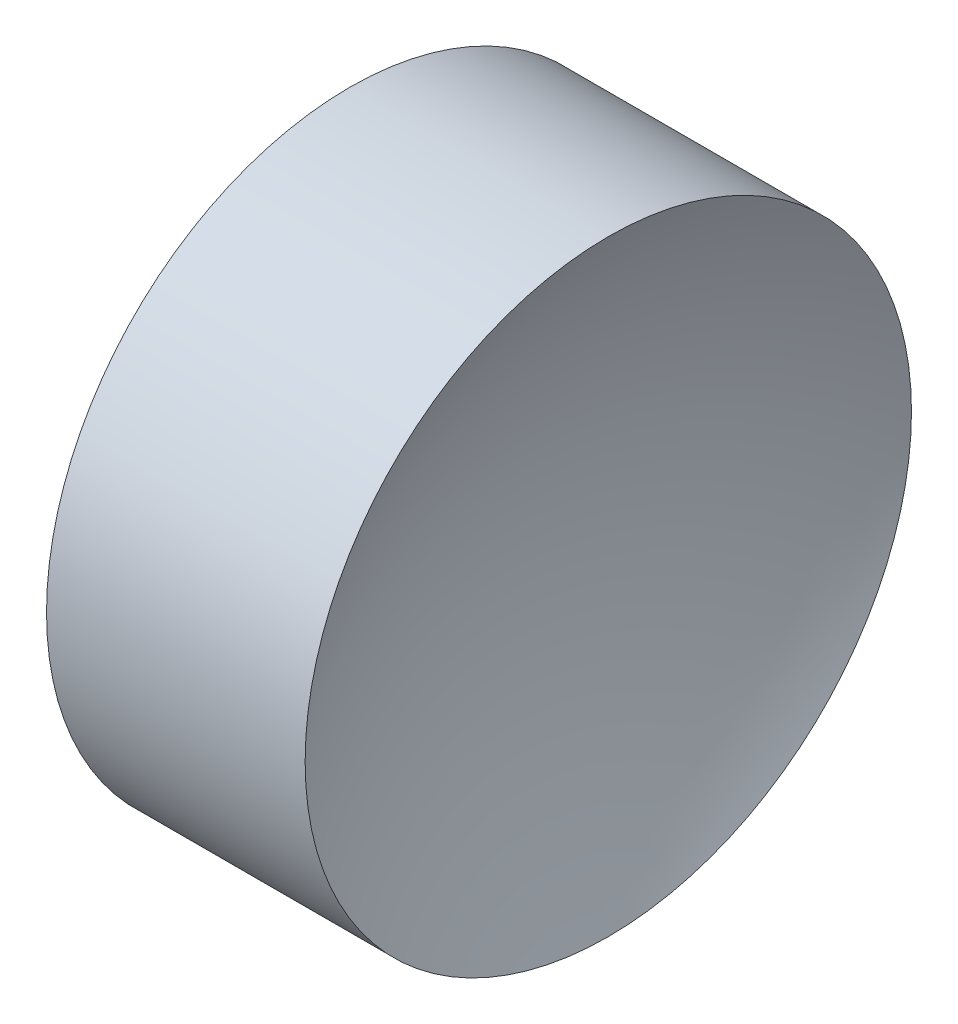
ISO-10303-21;
HEADER;
FILE_DESCRIPTION(('STEP AP214'),'2;1');
FILE_NAME('part.step','',(''),(''),'','','');
FILE_SCHEMA(('AUTOMOTIVE_DESIGN { 1 0 10303 214 1 1 1 1 }'));
ENDSEC;
DATA;
#1=APPLICATION_CONTEXT('core data for automotive mechanical design processes');
#2=APPLICATION_PROTOCOL_DEFINITION('international standard','automotive_design',2000,#1);
#3=PRODUCT_CONTEXT('',#1,'mechanical');
#4=PRODUCT('Part','Part','',(#3));
#5=PRODUCT_RELATED_PRODUCT_CATEGORY('part','',(#4));
#6=PRODUCT_DEFINITION_FORMATION('','',#4);
#7=PRODUCT_DEFINITION_CONTEXT('part definition',#1,'design');
#8=PRODUCT_DEFINITION('design','',#6,#7);
#9=PRODUCT_DEFINITION_SHAPE('','',#8);
#10=(LENGTH_UNIT() NAMED_UNIT(*) SI_UNIT(.MILLI.,.METRE.));
#11=(NAMED_UNIT(*) PLANE_ANGLE_UNIT() SI_UNIT($,.RADIAN.));
#12=(NAMED_UNIT(*) SI_UNIT($,.STERADIAN.) SOLID_ANGLE_UNIT());
#13=UNCERTAINTY_MEASURE_WITH_UNIT(LENGTH_MEASURE(1.E-05),#10,'distance_accuracy_value','');
#14=(GEOMETRIC_REPRESENTATION_CONTEXT(3) GLOBAL_UNCERTAINTY_ASSIGNED_CONTEXT((#13)) GLOBAL_UNIT_ASSIGNED_CONTEXT((#10,
#11,#12)) REPRESENTATION_CONTEXT('',''));
#15=CARTESIAN_POINT('',(0.,0.,0.));
#16=DIRECTION('',(0.,0.,1.));
#17=DIRECTION('',(1.,0.,0.));
#18=AXIS2_PLACEMENT_3D('',#15,#16,#17);
#19=CARTESIAN_POINT('',(32.72522198418,26.089041149195,0.));
#20=DIRECTION('',(-1.,0.,0.));
#21=DIRECTION('',(0.,1.,0.));
#22=AXIS2_PLACEMENT_3D('',#19,#20,#21);
#23=SPHERICAL_SURFACE('',#22,14.12);
#24=CARTESIAN_POINT('',(45.3367999980528,26.089041149195,0.));
#25=DIRECTION('',(-1.,0.,0.));
#26=DIRECTION('',(0.,0.,1.));
#27=AXIS2_PLACEMENT_3D('',#24,#25,#26);
#28=CIRCLE('',#27,6.35);
#29=CARTESIAN_POINT('',(45.3367999980528,26.089041149195,6.35));
#30=VERTEX_POINT('',#29);
#31=EDGE_CURVE('E41',#30,#30,#28,.T.);
#32=ORIENTED_EDGE('',*,*,#31,.T.);
#33=EDGE_LOOP('',(#32));
#34=FACE_BOUND('',#33,.T.);
#35=ADVANCED_FACE('F35',(#34),#23,.F.);
#36=CARTESIAN_POINT('',(63.36522198418,26.089041149195,0.));
#37=DIRECTION('',(-1.,0.,0.));
#38=DIRECTION('',(0.,1.,0.));
#39=AXIS2_PLACEMENT_3D('',#36,#37,#38);
#40=SPHERICAL_SURFACE('',#39,14.12);
#41=CARTESIAN_POINT('',(50.7536439703072,26.089041149195,0.));
#42=DIRECTION('',(-1.,0.,0.));
#43=DIRECTION('',(0.,0.,1.));
#44=AXIS2_PLACEMENT_3D('',#41,#42,#43);
#45=CIRCLE('',#44,6.35);
#46=CARTESIAN_POINT('',(50.7536439703072,26.089041149195,6.35));
#47=VERTEX_POINT('',#46);
#48=EDGE_CURVE('E10',#47,#47,#45,.T.);
#49=ORIENTED_EDGE('',*,*,#48,.F.);
#50=EDGE_LOOP('',(#49));
#51=FACE_BOUND('',#50,.T.);
#52=ADVANCED_FACE('F50',(#51),#40,.F.);
#53=CARTESIAN_POINT('',(42.4498611141368,26.089041149195,0.));
#54=DIRECTION('',(-1.,0.,0.));
#55=DIRECTION('',(0.,0.,1.));
#56=AXIS2_PLACEMENT_3D('',#53,#54,#55);
#57=CYLINDRICAL_SURFACE('',#56,6.35);
#58=ORIENTED_EDGE('',*,*,#31,.F.);
#59=EDGE_LOOP('',(#58));
#60=FACE_BOUND('',#59,.T.);
#61=ORIENTED_EDGE('',*,*,#48,.T.);
#62=EDGE_LOOP('',(#61));
#63=FACE_BOUND('',#62,.T.);
#64=ADVANCED_FACE('F48',(#60,#63),#57,.T.);
#65=CLOSED_SHELL('',(#35,#52,#64));
#66=MANIFOLD_SOLID_BREP('B2',#65);
#67=ADVANCED_BREP_SHAPE_REPRESENTATION('',(#18,#66),#14);
#68=SHAPE_DEFINITION_REPRESENTATION(#9,#67);
ENDSEC;
END-ISO-10303-21;
